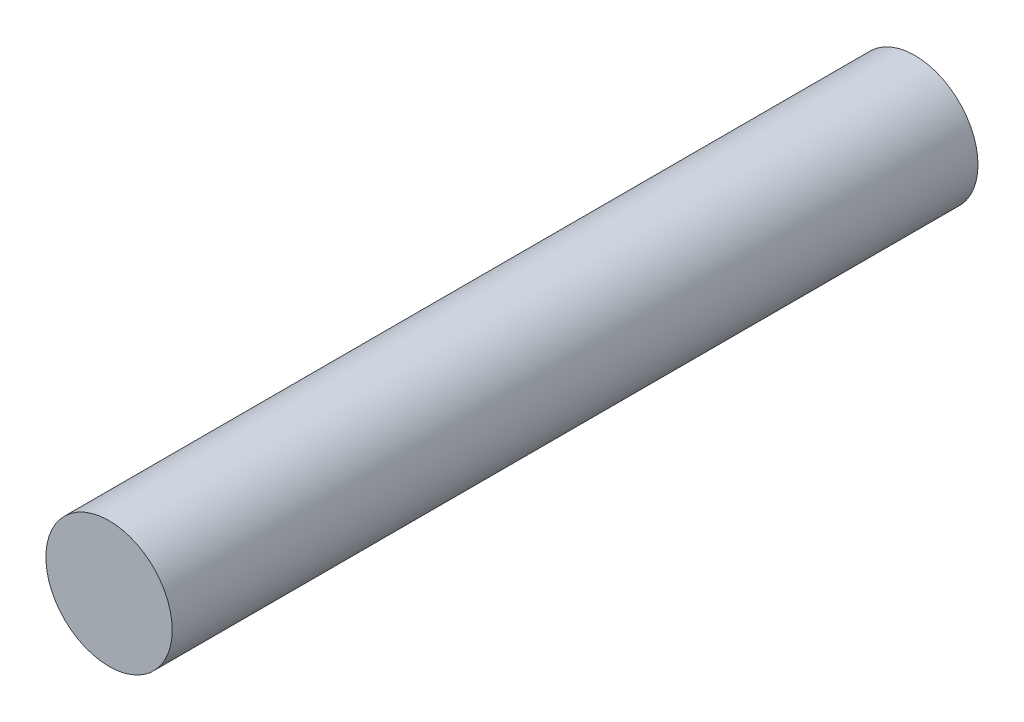
ISO-10303-21;
HEADER;
FILE_DESCRIPTION(('STEP AP214'),'2;1');
FILE_NAME('part.step','',(''),(''),'','','');
FILE_SCHEMA(('AUTOMOTIVE_DESIGN { 1 0 10303 214 1 1 1 1 }'));
ENDSEC;
DATA;
#1=APPLICATION_CONTEXT('core data for automotive mechanical design processes');
#2=APPLICATION_PROTOCOL_DEFINITION('international standard','automotive_design',2000,#1);
#3=PRODUCT_CONTEXT('',#1,'mechanical');
#4=PRODUCT('Part','Part','',(#3));
#5=PRODUCT_RELATED_PRODUCT_CATEGORY('part','',(#4));
#6=PRODUCT_DEFINITION_FORMATION('','',#4);
#7=PRODUCT_DEFINITION_CONTEXT('part definition',#1,'design');
#8=PRODUCT_DEFINITION('design','',#6,#7);
#9=PRODUCT_DEFINITION_SHAPE('','',#8);
#10=(LENGTH_UNIT() NAMED_UNIT(*) SI_UNIT(.MILLI.,.METRE.));
#11=(NAMED_UNIT(*) PLANE_ANGLE_UNIT() SI_UNIT($,.RADIAN.));
#12=(NAMED_UNIT(*) SI_UNIT($,.STERADIAN.) SOLID_ANGLE_UNIT());
#13=UNCERTAINTY_MEASURE_WITH_UNIT(LENGTH_MEASURE(1.E-05),#10,'distance_accuracy_value','');
#14=(GEOMETRIC_REPRESENTATION_CONTEXT(3) GLOBAL_UNCERTAINTY_ASSIGNED_CONTEXT((#13)) GLOBAL_UNIT_ASSIGNED_CONTEXT((#10,
#11,#12)) REPRESENTATION_CONTEXT('',''));
#15=CARTESIAN_POINT('',(0.,0.,0.));
#16=DIRECTION('',(0.,0.,1.));
#17=DIRECTION('',(1.,0.,0.));
#18=AXIS2_PLACEMENT_3D('',#15,#16,#17);
#19=CARTESIAN_POINT('',(-36.0679999999998,0.,-40.8205122421379));
#20=DIRECTION('',(0.,0.,1.));
#21=DIRECTION('',(1.,0.,0.));
#22=AXIS2_PLACEMENT_3D('',#19,#20,#21);
#23=CYLINDRICAL_SURFACE('',#22,6.34999999999986);
#24=CARTESIAN_POINT('',(-36.0679999999998,0.,-22.86));
#25=DIRECTION('',(0.,0.,1.));
#26=DIRECTION('',(1.,0.,0.));
#27=AXIS2_PLACEMENT_3D('',#24,#25,#26);
#28=CIRCLE('',#27,6.34999999999986);
#29=CARTESIAN_POINT('',(-29.7179999999999,0.,-22.86));
#30=VERTEX_POINT('',#29);
#31=EDGE_CURVE('E10',#30,#30,#28,.F.);
#32=ORIENTED_EDGE('',*,*,#31,.F.);
#33=EDGE_LOOP('',(#32));
#34=FACE_BOUND('',#33,.T.);
#35=CARTESIAN_POINT('',(-36.0679999999998,0.,58.1634600000004));
#36=DIRECTION('',(0.,0.,1.));
#37=DIRECTION('',(1.,0.,0.));
#38=AXIS2_PLACEMENT_3D('',#35,#36,#37);
#39=CIRCLE('',#38,6.34999999999986);
#40=CARTESIAN_POINT('',(-29.7179999999999,0.,58.1634600000004));
#41=VERTEX_POINT('',#40);
#42=EDGE_CURVE('E37',#41,#41,#39,.T.);
#43=ORIENTED_EDGE('',*,*,#42,.F.);
#44=EDGE_LOOP('',(#43));
#45=FACE_BOUND('',#44,.T.);
#46=ADVANCED_FACE('F31',(#34,#45),#23,.T.);
#47=CARTESIAN_POINT('',(-36.0679999999998,0.,58.1634600000004));
#48=DIRECTION('',(0.,0.,1.));
#49=DIRECTION('',(1.,0.,0.));
#50=AXIS2_PLACEMENT_3D('',#47,#48,#49);
#51=PLANE('',#50);
#52=ORIENTED_EDGE('',*,*,#42,.T.);
#53=EDGE_LOOP('',(#52));
#54=FACE_BOUND('',#53,.T.);
#55=ADVANCED_FACE('F43',(#54),#51,.T.);
#56=CARTESIAN_POINT('',(0.,0.,-22.86));
#57=DIRECTION('',(0.,0.,1.));
#58=DIRECTION('',(1.,0.,0.));
#59=AXIS2_PLACEMENT_3D('',#56,#57,#58);
#60=PLANE('',#59);
#61=ORIENTED_EDGE('',*,*,#31,.T.);
#62=EDGE_LOOP('',(#61));
#63=FACE_BOUND('',#62,.T.);
#64=ADVANCED_FACE('F50',(#63),#60,.F.);
#65=CLOSED_SHELL('',(#46,#55,#64));
#66=MANIFOLD_SOLID_BREP('B2',#65);
#67=ADVANCED_BREP_SHAPE_REPRESENTATION('',(#18,#66),#14);
#68=SHAPE_DEFINITION_REPRESENTATION(#9,#67);
ENDSEC;
END-ISO-10303-21;
